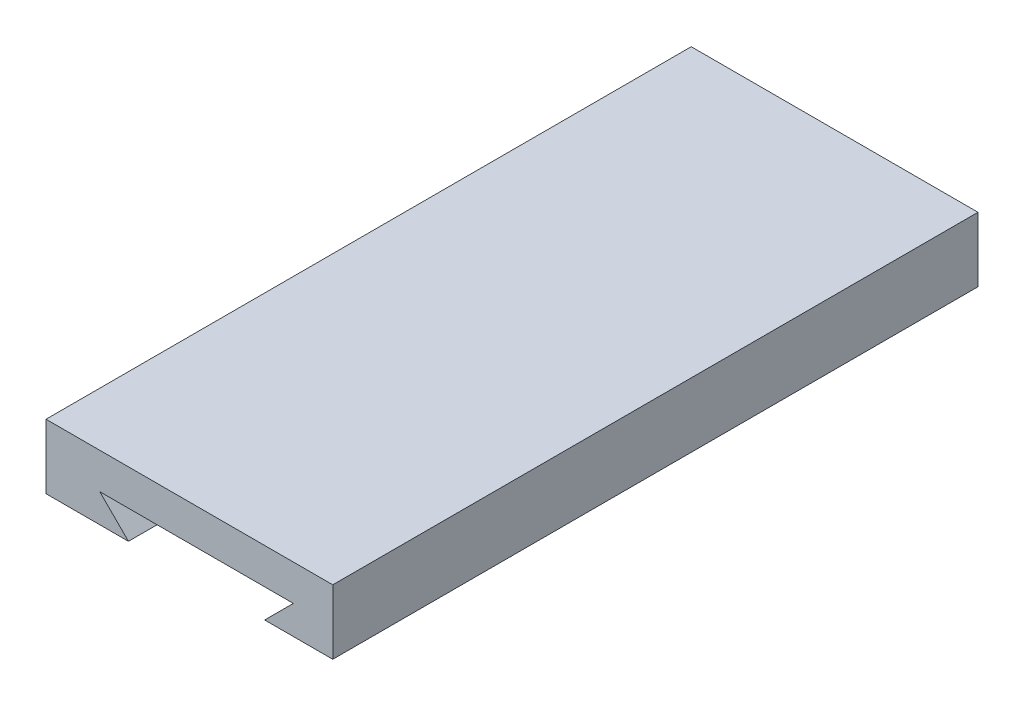
ISO-10303-21;
HEADER;
FILE_DESCRIPTION(('STEP AP214'),'2;1');
FILE_NAME('part.step','',(''),(''),'','','');
FILE_SCHEMA(('AUTOMOTIVE_DESIGN { 1 0 10303 214 1 1 1 1 }'));
ENDSEC;
DATA;
#1=APPLICATION_CONTEXT('core data for automotive mechanical design processes');
#2=APPLICATION_PROTOCOL_DEFINITION('international standard','automotive_design',2000,#1);
#3=PRODUCT_CONTEXT('',#1,'mechanical');
#4=PRODUCT('Part','Part','',(#3));
#5=PRODUCT_RELATED_PRODUCT_CATEGORY('part','',(#4));
#6=PRODUCT_DEFINITION_FORMATION('','',#4);
#7=PRODUCT_DEFINITION_CONTEXT('part definition',#1,'design');
#8=PRODUCT_DEFINITION('design','',#6,#7);
#9=PRODUCT_DEFINITION_SHAPE('','',#8);
#10=(LENGTH_UNIT() NAMED_UNIT(*) SI_UNIT(.MILLI.,.METRE.));
#11=(NAMED_UNIT(*) PLANE_ANGLE_UNIT() SI_UNIT($,.RADIAN.));
#12=(NAMED_UNIT(*) SI_UNIT($,.STERADIAN.) SOLID_ANGLE_UNIT());
#13=UNCERTAINTY_MEASURE_WITH_UNIT(LENGTH_MEASURE(1.E-05),#10,'distance_accuracy_value','');
#14=(GEOMETRIC_REPRESENTATION_CONTEXT(3) GLOBAL_UNCERTAINTY_ASSIGNED_CONTEXT((#13)) GLOBAL_UNIT_ASSIGNED_CONTEXT((#10,
#11,#12)) REPRESENTATION_CONTEXT('',''));
#15=CARTESIAN_POINT('',(0.,0.,0.));
#16=DIRECTION('',(0.,0.,1.));
#17=DIRECTION('',(1.,0.,0.));
#18=AXIS2_PLACEMENT_3D('',#15,#16,#17);
#19=CARTESIAN_POINT('',(-51.0210696920583,5.82495948136142,180.));
#20=DIRECTION('',(0.,1.,0.));
#21=DIRECTION('',(0.,0.,1.));
#22=AXIS2_PLACEMENT_3D('',#19,#20,#21);
#23=PLANE('',#22);
#24=DIRECTION('',(0.,0.,-1.));
#25=VECTOR('',#24,1.);
#26=CARTESIAN_POINT('',(9.97893030794158,5.82495948136142,180.000012));
#27=LINE('',#26,#25);
#28=CARTESIAN_POINT('',(9.97893030794158,5.82495948136142,180.));
#29=VERTEX_POINT('',#28);
#30=CARTESIAN_POINT('',(9.97893030794158,5.82495948136142,0.));
#31=VERTEX_POINT('',#30);
#32=EDGE_CURVE('E117',#29,#31,#27,.T.);
#33=ORIENTED_EDGE('',*,*,#32,.T.);
#34=DIRECTION('',(1.,0.,0.));
#35=VECTOR('',#34,1.);
#36=CARTESIAN_POINT('',(-51.0210696920583,5.82495948136142,0.));
#37=LINE('',#36,#35);
#38=CARTESIAN_POINT('',(28.9789303079417,5.82495948136142,0.));
#39=VERTEX_POINT('',#38);
#40=EDGE_CURVE('E131',#31,#39,#37,.T.);
#41=ORIENTED_EDGE('',*,*,#40,.T.);
#42=DIRECTION('',(0.,0.,-1.));
#43=VECTOR('',#42,1.);
#44=CARTESIAN_POINT('',(28.9789303079417,5.82495948136142,180.));
#45=LINE('',#44,#43);
#46=CARTESIAN_POINT('',(28.9789303079417,5.82495948136142,180.));
#47=VERTEX_POINT('',#46);
#48=EDGE_CURVE('E48',#47,#39,#45,.T.);
#49=ORIENTED_EDGE('',*,*,#48,.F.);
#50=DIRECTION('',(1.,0.,0.));
#51=VECTOR('',#50,1.);
#52=CARTESIAN_POINT('',(-51.0210696920583,5.82495948136142,180.));
#53=LINE('',#52,#51);
#54=EDGE_CURVE('E133',#29,#47,#53,.T.);
#55=ORIENTED_EDGE('',*,*,#54,.F.);
#56=EDGE_LOOP('',(#33,#41,#49,#55));
#57=FACE_BOUND('',#56,.T.);
#58=ADVANCED_FACE('F39',(#57),#23,.F.);
#59=DIRECTION('',(0.,0.,-1.));
#60=VECTOR('',#59,1.);
#61=CARTESIAN_POINT('',(-28.0210696920583,5.82495948136142,180.000012));
#62=LINE('',#61,#60);
#63=CARTESIAN_POINT('',(-28.0210696920583,5.82495948136142,180.));
#64=VERTEX_POINT('',#63);
#65=CARTESIAN_POINT('',(-28.0210696920583,5.82495948136143,0.));
#66=VERTEX_POINT('',#65);
#67=EDGE_CURVE('E55',#64,#66,#62,.T.);
#68=ORIENTED_EDGE('',*,*,#67,.F.);
#69=CARTESIAN_POINT('',(-51.0210696920583,5.82495948136142,180.));
#70=VERTEX_POINT('',#69);
#71=EDGE_CURVE('E91',#70,#64,#53,.T.);
#72=ORIENTED_EDGE('',*,*,#71,.F.);
#73=DIRECTION('',(0.,0.,-1.));
#74=VECTOR('',#73,1.);
#75=CARTESIAN_POINT('',(-51.0210696920583,5.82495948136142,180.));
#76=LINE('',#75,#74);
#77=CARTESIAN_POINT('',(-51.0210696920583,5.82495948136142,0.));
#78=VERTEX_POINT('',#77);
#79=EDGE_CURVE('E11',#70,#78,#76,.T.);
#80=ORIENTED_EDGE('',*,*,#79,.T.);
#81=EDGE_CURVE('E141',#78,#66,#37,.T.);
#82=ORIENTED_EDGE('',*,*,#81,.T.);
#83=EDGE_LOOP('',(#68,#72,#80,#82));
#84=FACE_BOUND('',#83,.T.);
#85=ADVANCED_FACE('F207',(#84),#23,.F.);
#86=CARTESIAN_POINT('',(0.,0.,180.));
#87=DIRECTION('',(0.,0.,1.));
#88=DIRECTION('',(1.,0.,0.));
#89=AXIS2_PLACEMENT_3D('',#86,#87,#88);
#90=PLANE('',#89);
#91=DIRECTION('',(1.,0.,0.));
#92=VECTOR('',#91,1.);
#93=CARTESIAN_POINT('',(0.,13.8249594813614,180.));
#94=LINE('',#93,#92);
#95=CARTESIAN_POINT('',(-36.0210696920583,13.8249594813614,180.));
#96=VERTEX_POINT('',#95);
#97=CARTESIAN_POINT('',(17.9789303079417,13.8249594813614,180.));
#98=VERTEX_POINT('',#97);
#99=EDGE_CURVE('E178',#96,#98,#94,.T.);
#100=ORIENTED_EDGE('',*,*,#99,.T.);
#101=DIRECTION('',(-0.707106781186551,-0.707106781186544,0.));
#102=VECTOR('',#101,1.);
#103=CARTESIAN_POINT('',(2.07698541329003,-2.07698541329005,180.));
#104=LINE('',#103,#102);
#105=EDGE_CURVE('E148',#98,#29,#104,.T.);
#106=ORIENTED_EDGE('',*,*,#105,.T.);
#107=ORIENTED_EDGE('',*,*,#54,.T.);
#108=DIRECTION('',(0.,1.,0.));
#109=VECTOR('',#108,1.);
#110=CARTESIAN_POINT('',(28.9789303079417,23.8249594813614,180.));
#111=LINE('',#110,#109);
#112=CARTESIAN_POINT('',(28.9789303079417,23.8249594813614,180.));
#113=VERTEX_POINT('',#112);
#114=EDGE_CURVE('E167',#47,#113,#111,.T.);
#115=ORIENTED_EDGE('',*,*,#114,.T.);
#116=DIRECTION('',(-1.,0.,0.));
#117=VECTOR('',#116,1.);
#118=CARTESIAN_POINT('',(-51.0210696920583,23.8249594813614,180.));
#119=LINE('',#118,#117);
#120=CARTESIAN_POINT('',(-51.0210696920583,23.8249594813614,180.));
#121=VERTEX_POINT('',#120);
#122=EDGE_CURVE('E64',#113,#121,#119,.T.);
#123=ORIENTED_EDGE('',*,*,#122,.T.);
#124=DIRECTION('',(0.,-1.,0.));
#125=VECTOR('',#124,1.);
#126=CARTESIAN_POINT('',(-51.0210696920583,23.8249594813614,180.));
#127=LINE('',#126,#125);
#128=EDGE_CURVE('E156',#121,#70,#127,.T.);
#129=ORIENTED_EDGE('',*,*,#128,.T.);
#130=ORIENTED_EDGE('',*,*,#71,.T.);
#131=DIRECTION('',(-0.707106781186551,0.707106781186544,0.));
#132=VECTOR('',#131,1.);
#133=CARTESIAN_POINT('',(-11.0980551053483,-11.0980551053484,180.));
#134=LINE('',#133,#132);
#135=EDGE_CURVE('E135',#64,#96,#134,.T.);
#136=ORIENTED_EDGE('',*,*,#135,.T.);
#137=EDGE_LOOP('',(#100,#106,#107,#115,#123,#129,#130,#136));
#138=FACE_BOUND('',#137,.T.);
#139=ADVANCED_FACE('F211',(#138),#90,.T.);
#140=CARTESIAN_POINT('',(0.,0.,0.));
#141=DIRECTION('',(0.,0.,1.));
#142=DIRECTION('',(1.,0.,0.));
#143=AXIS2_PLACEMENT_3D('',#140,#141,#142);
#144=PLANE('',#143);
#145=DIRECTION('',(0.707106781186551,0.707106781186544,0.));
#146=VECTOR('',#145,1.);
#147=CARTESIAN_POINT('',(17.9789303079417,13.8249594813614,0.));
#148=LINE('',#147,#146);
#149=CARTESIAN_POINT('',(17.9789303079417,13.8249594813614,0.));
#150=VERTEX_POINT('',#149);
#151=EDGE_CURVE('E114',#31,#150,#148,.T.);
#152=ORIENTED_EDGE('',*,*,#151,.T.);
#153=DIRECTION('',(-1.,0.,0.));
#154=VECTOR('',#153,1.);
#155=CARTESIAN_POINT('',(-36.0210696920583,13.8249594813614,0.));
#156=LINE('',#155,#154);
#157=CARTESIAN_POINT('',(-36.0210696920583,13.8249594813614,0.));
#158=VERTEX_POINT('',#157);
#159=EDGE_CURVE('E126',#150,#158,#156,.T.);
#160=ORIENTED_EDGE('',*,*,#159,.T.);
#161=DIRECTION('',(0.707106781186551,-0.707106781186544,0.));
#162=VECTOR('',#161,1.);
#163=CARTESIAN_POINT('',(-28.0210696920583,5.82495948136142,0.));
#164=LINE('',#163,#162);
#165=EDGE_CURVE('E192',#158,#66,#164,.T.);
#166=ORIENTED_EDGE('',*,*,#165,.T.);
#167=ORIENTED_EDGE('',*,*,#81,.F.);
#168=DIRECTION('',(0.,-1.,0.));
#169=VECTOR('',#168,1.);
#170=CARTESIAN_POINT('',(-51.0210696920583,23.8249594813614,0.));
#171=LINE('',#170,#169);
#172=CARTESIAN_POINT('',(-51.0210696920583,23.8249594813614,0.));
#173=VERTEX_POINT('',#172);
#174=EDGE_CURVE('E142',#173,#78,#171,.T.);
#175=ORIENTED_EDGE('',*,*,#174,.F.);
#176=DIRECTION('',(-1.,0.,0.));
#177=VECTOR('',#176,1.);
#178=CARTESIAN_POINT('',(-51.0210696920583,23.8249594813614,0.));
#179=LINE('',#178,#177);
#180=CARTESIAN_POINT('',(28.9789303079417,23.8249594813614,0.));
#181=VERTEX_POINT('',#180);
#182=EDGE_CURVE('E85',#181,#173,#179,.T.);
#183=ORIENTED_EDGE('',*,*,#182,.F.);
#184=DIRECTION('',(0.,1.,0.));
#185=VECTOR('',#184,1.);
#186=CARTESIAN_POINT('',(28.9789303079417,23.8249594813614,0.));
#187=LINE('',#186,#185);
#188=EDGE_CURVE('E139',#39,#181,#187,.T.);
#189=ORIENTED_EDGE('',*,*,#188,.F.);
#190=ORIENTED_EDGE('',*,*,#40,.F.);
#191=EDGE_LOOP('',(#152,#160,#166,#167,#175,#183,#189,#190));
#192=FACE_BOUND('',#191,.T.);
#193=ADVANCED_FACE('F138',(#192),#144,.F.);
#194=CARTESIAN_POINT('',(-51.0210696920583,23.8249594813614,180.));
#195=DIRECTION('',(1.,0.,0.));
#196=DIRECTION('',(0.,1.,0.));
#197=AXIS2_PLACEMENT_3D('',#194,#195,#196);
#198=PLANE('',#197);
#199=ORIENTED_EDGE('',*,*,#174,.T.);
#200=ORIENTED_EDGE('',*,*,#79,.F.);
#201=ORIENTED_EDGE('',*,*,#128,.F.);
#202=DIRECTION('',(0.,0.,-1.));
#203=VECTOR('',#202,1.);
#204=CARTESIAN_POINT('',(-51.0210696920583,23.8249594813614,180.));
#205=LINE('',#204,#203);
#206=EDGE_CURVE('E157',#121,#173,#205,.T.);
#207=ORIENTED_EDGE('',*,*,#206,.T.);
#208=EDGE_LOOP('',(#199,#200,#201,#207));
#209=FACE_BOUND('',#208,.T.);
#210=ADVANCED_FACE('F41',(#209),#198,.F.);
#211=CARTESIAN_POINT('',(28.9789303079417,23.8249594813614,180.));
#212=DIRECTION('',(-1.,0.,0.));
#213=DIRECTION('',(0.,-1.,0.));
#214=AXIS2_PLACEMENT_3D('',#211,#212,#213);
#215=PLANE('',#214);
#216=ORIENTED_EDGE('',*,*,#188,.T.);
#217=DIRECTION('',(0.,0.,-1.));
#218=VECTOR('',#217,1.);
#219=CARTESIAN_POINT('',(28.9789303079417,23.8249594813614,180.));
#220=LINE('',#219,#218);
#221=EDGE_CURVE('E160',#113,#181,#220,.T.);
#222=ORIENTED_EDGE('',*,*,#221,.F.);
#223=ORIENTED_EDGE('',*,*,#114,.F.);
#224=ORIENTED_EDGE('',*,*,#48,.T.);
#225=EDGE_LOOP('',(#216,#222,#223,#224));
#226=FACE_BOUND('',#225,.T.);
#227=ADVANCED_FACE('F165',(#226),#215,.F.);
#228=CARTESIAN_POINT('',(-51.0210696920583,23.8249594813614,180.));
#229=DIRECTION('',(0.,-1.,0.));
#230=DIRECTION('',(0.,0.,-1.));
#231=AXIS2_PLACEMENT_3D('',#228,#229,#230);
#232=PLANE('',#231);
#233=ORIENTED_EDGE('',*,*,#182,.T.);
#234=ORIENTED_EDGE('',*,*,#206,.F.);
#235=ORIENTED_EDGE('',*,*,#122,.F.);
#236=ORIENTED_EDGE('',*,*,#221,.T.);
#237=EDGE_LOOP('',(#233,#234,#235,#236));
#238=FACE_BOUND('',#237,.T.);
#239=ADVANCED_FACE('F215',(#238),#232,.F.);
#240=CARTESIAN_POINT('',(17.9789303079417,13.8249594813614,180.000012));
#241=DIRECTION('',(-0.707106781186544,0.707106781186551,0.));
#242=DIRECTION('',(-0.707106781186551,-0.707106781186544,0.));
#243=AXIS2_PLACEMENT_3D('',#240,#241,#242);
#244=PLANE('',#243);
#245=DIRECTION('',(0.,0.,-1.));
#246=VECTOR('',#245,1.);
#247=CARTESIAN_POINT('',(17.9789303079417,13.8249594813614,180.000012));
#248=LINE('',#247,#246);
#249=EDGE_CURVE('E120',#98,#150,#248,.T.);
#250=ORIENTED_EDGE('',*,*,#249,.T.);
#251=ORIENTED_EDGE('',*,*,#151,.F.);
#252=ORIENTED_EDGE('',*,*,#32,.F.);
#253=ORIENTED_EDGE('',*,*,#105,.F.);
#254=EDGE_LOOP('',(#250,#251,#252,#253));
#255=FACE_BOUND('',#254,.T.);
#256=ADVANCED_FACE('F116',(#255),#244,.T.);
#257=CARTESIAN_POINT('',(-36.0210696920583,13.8249594813614,180.000012));
#258=DIRECTION('',(0.,-1.,0.));
#259=DIRECTION('',(0.,0.,-1.));
#260=AXIS2_PLACEMENT_3D('',#257,#258,#259);
#261=PLANE('',#260);
#262=DIRECTION('',(0.,0.,-1.));
#263=VECTOR('',#262,1.);
#264=CARTESIAN_POINT('',(-36.0210696920583,13.8249594813614,180.000012));
#265=LINE('',#264,#263);
#266=EDGE_CURVE('E187',#96,#158,#265,.T.);
#267=ORIENTED_EDGE('',*,*,#266,.T.);
#268=ORIENTED_EDGE('',*,*,#159,.F.);
#269=ORIENTED_EDGE('',*,*,#249,.F.);
#270=ORIENTED_EDGE('',*,*,#99,.F.);
#271=EDGE_LOOP('',(#267,#268,#269,#270));
#272=FACE_BOUND('',#271,.T.);
#273=ADVANCED_FACE('F197',(#272),#261,.T.);
#274=CARTESIAN_POINT('',(-28.0210696920583,5.82495948136142,180.000012));
#275=DIRECTION('',(0.707106781186544,0.707106781186551,0.));
#276=DIRECTION('',(-0.707106781186551,0.707106781186544,0.));
#277=AXIS2_PLACEMENT_3D('',#274,#275,#276);
#278=PLANE('',#277);
#279=ORIENTED_EDGE('',*,*,#67,.T.);
#280=ORIENTED_EDGE('',*,*,#165,.F.);
#281=ORIENTED_EDGE('',*,*,#266,.F.);
#282=ORIENTED_EDGE('',*,*,#135,.F.);
#283=EDGE_LOOP('',(#279,#280,#281,#282));
#284=FACE_BOUND('',#283,.T.);
#285=ADVANCED_FACE('F199',(#284),#278,.T.);
#286=CLOSED_SHELL('',(#58,#85,#139,#193,#210,#227,#239,#256,#273,#285));
#287=MANIFOLD_SOLID_BREP('B2',#286);
#288=ADVANCED_BREP_SHAPE_REPRESENTATION('',(#18,#287),#14);
#289=SHAPE_DEFINITION_REPRESENTATION(#9,#288);
ENDSEC;
END-ISO-10303-21;
